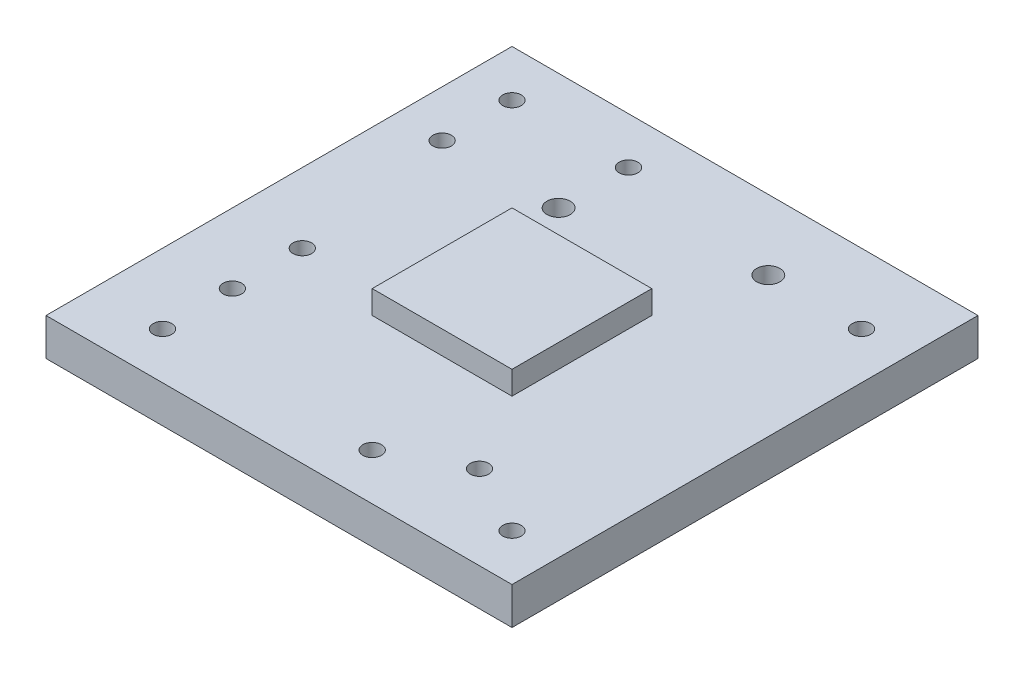
ISO-10303-21;
HEADER;
FILE_DESCRIPTION(('STEP AP214'),'2;1');
FILE_NAME('part.step','',(''),(''),'','','');
FILE_SCHEMA(('AUTOMOTIVE_DESIGN { 1 0 10303 214 1 1 1 1 }'));
ENDSEC;
DATA;
#1=APPLICATION_CONTEXT('core data for automotive mechanical design processes');
#2=APPLICATION_PROTOCOL_DEFINITION('international standard','automotive_design',2000,#1);
#3=PRODUCT_CONTEXT('',#1,'mechanical');
#4=PRODUCT('Part','Part','',(#3));
#5=PRODUCT_RELATED_PRODUCT_CATEGORY('part','',(#4));
#6=PRODUCT_DEFINITION_FORMATION('','',#4);
#7=PRODUCT_DEFINITION_CONTEXT('part definition',#1,'design');
#8=PRODUCT_DEFINITION('design','',#6,#7);
#9=PRODUCT_DEFINITION_SHAPE('','',#8);
#10=(LENGTH_UNIT() NAMED_UNIT(*) SI_UNIT(.MILLI.,.METRE.));
#11=(NAMED_UNIT(*) PLANE_ANGLE_UNIT() SI_UNIT($,.RADIAN.));
#12=(NAMED_UNIT(*) SI_UNIT($,.STERADIAN.) SOLID_ANGLE_UNIT());
#13=UNCERTAINTY_MEASURE_WITH_UNIT(LENGTH_MEASURE(1.E-05),#10,'distance_accuracy_value','');
#14=(GEOMETRIC_REPRESENTATION_CONTEXT(3) GLOBAL_UNCERTAINTY_ASSIGNED_CONTEXT((#13)) GLOBAL_UNIT_ASSIGNED_CONTEXT((#10,
#11,#12)) REPRESENTATION_CONTEXT('',''));
#15=CARTESIAN_POINT('',(0.,0.,0.));
#16=DIRECTION('',(0.,0.,1.));
#17=DIRECTION('',(1.,0.,0.));
#18=AXIS2_PLACEMENT_3D('',#15,#16,#17);
#19=CARTESIAN_POINT('',(0.,8.,0.));
#20=DIRECTION('',(0.,-1.,0.));
#21=DIRECTION('',(0.,0.,-1.));
#22=AXIS2_PLACEMENT_3D('',#19,#20,#21);
#23=PLANE('',#22);
#24=CARTESIAN_POINT('',(90.,8.,-10.));
#25=DIRECTION('',(0.,1.,0.));
#26=DIRECTION('',(0.,0.,1.));
#27=AXIS2_PLACEMENT_3D('',#24,#25,#26);
#28=CIRCLE('',#27,2.);
#29=CARTESIAN_POINT('',(90.,8.,-8.));
#30=VERTEX_POINT('',#29);
#31=EDGE_CURVE('E218',#30,#30,#28,.T.);
#32=ORIENTED_EDGE('',*,*,#31,.F.);
#33=EDGE_LOOP('',(#32));
#34=FACE_BOUND('',#33,.T.);
#35=CARTESIAN_POINT('',(60.,8.,-10.));
#36=DIRECTION('',(0.,1.,0.));
#37=DIRECTION('',(0.,0.,1.));
#38=AXIS2_PLACEMENT_3D('',#35,#36,#37);
#39=CIRCLE('',#38,2.);
#40=CARTESIAN_POINT('',(60.,8.,-8.));
#41=VERTEX_POINT('',#40);
#42=EDGE_CURVE('E513',#41,#41,#39,.T.);
#43=ORIENTED_EDGE('',*,*,#42,.F.);
#44=EDGE_LOOP('',(#43));
#45=FACE_BOUND('',#44,.T.);
#46=CARTESIAN_POINT('',(75.,8.,-18.0259116252399));
#47=DIRECTION('',(0.,1.,0.));
#48=DIRECTION('',(0.,0.,1.));
#49=AXIS2_PLACEMENT_3D('',#46,#47,#48);
#50=CIRCLE('',#49,2.);
#51=CARTESIAN_POINT('',(75.,8.,-16.0259116252399));
#52=VERTEX_POINT('',#51);
#53=EDGE_CURVE('E517',#52,#52,#50,.T.);
#54=ORIENTED_EDGE('',*,*,#53,.F.);
#55=EDGE_LOOP('',(#54));
#56=FACE_BOUND('',#55,.T.);
#57=CARTESIAN_POINT('',(15.,8.,-9.99999999999999));
#58=DIRECTION('',(0.,1.,0.));
#59=DIRECTION('',(0.,0.,1.));
#60=AXIS2_PLACEMENT_3D('',#57,#58,#59);
#61=CIRCLE('',#60,2.);
#62=CARTESIAN_POINT('',(15.,8.,-7.99999999999999));
#63=VERTEX_POINT('',#62);
#64=EDGE_CURVE('E205',#63,#63,#61,.T.);
#65=ORIENTED_EDGE('',*,*,#64,.F.);
#66=EDGE_LOOP('',(#65));
#67=FACE_BOUND('',#66,.T.);
#68=CARTESIAN_POINT('',(15.,8.,-25.));
#69=DIRECTION('',(0.,1.,0.));
#70=DIRECTION('',(0.,0.,1.));
#71=AXIS2_PLACEMENT_3D('',#68,#69,#70);
#72=CIRCLE('',#71,2.);
#73=CARTESIAN_POINT('',(15.,8.,-23.));
#74=VERTEX_POINT('',#73);
#75=EDGE_CURVE('E230',#74,#74,#72,.T.);
#76=ORIENTED_EDGE('',*,*,#75,.F.);
#77=EDGE_LOOP('',(#76));
#78=FACE_BOUND('',#77,.T.);
#79=CARTESIAN_POINT('',(15.,8.,-40.));
#80=DIRECTION('',(0.,1.,0.));
#81=DIRECTION('',(0.,0.,1.));
#82=AXIS2_PLACEMENT_3D('',#79,#80,#81);
#83=CIRCLE('',#82,2.);
#84=CARTESIAN_POINT('',(15.,8.,-38.));
#85=VERTEX_POINT('',#84);
#86=EDGE_CURVE('E225',#85,#85,#83,.T.);
#87=ORIENTED_EDGE('',*,*,#86,.F.);
#88=EDGE_LOOP('',(#87));
#89=FACE_BOUND('',#88,.T.);
#90=CARTESIAN_POINT('',(90.,8.,-85.));
#91=DIRECTION('',(0.,1.,0.));
#92=DIRECTION('',(0.,0.,1.));
#93=AXIS2_PLACEMENT_3D('',#90,#91,#92);
#94=CIRCLE('',#93,2.);
#95=CARTESIAN_POINT('',(90.,8.,-83.));
#96=VERTEX_POINT('',#95);
#97=EDGE_CURVE('E195',#96,#96,#94,.T.);
#98=ORIENTED_EDGE('',*,*,#97,.F.);
#99=EDGE_LOOP('',(#98));
#100=FACE_BOUND('',#99,.T.);
#101=CARTESIAN_POINT('',(70.,8.,-85.));
#102=DIRECTION('',(0.,1.,0.));
#103=DIRECTION('',(0.,0.,1.));
#104=AXIS2_PLACEMENT_3D('',#101,#102,#103);
#105=CIRCLE('',#104,2.5);
#106=CARTESIAN_POINT('',(70.,8.,-82.5));
#107=VERTEX_POINT('',#106);
#108=EDGE_CURVE('E213',#107,#107,#105,.T.);
#109=ORIENTED_EDGE('',*,*,#108,.F.);
#110=EDGE_LOOP('',(#109));
#111=FACE_BOUND('',#110,.T.);
#112=CARTESIAN_POINT('',(35.,8.,-90.));
#113=DIRECTION('',(0.,1.,0.));
#114=DIRECTION('',(0.,0.,1.));
#115=AXIS2_PLACEMENT_3D('',#112,#113,#114);
#116=CIRCLE('',#115,2.);
#117=CARTESIAN_POINT('',(35.,8.,-88.));
#118=VERTEX_POINT('',#117);
#119=EDGE_CURVE('E249',#118,#118,#116,.T.);
#120=ORIENTED_EDGE('',*,*,#119,.F.);
#121=EDGE_LOOP('',(#120));
#122=FACE_BOUND('',#121,.T.);
#123=CARTESIAN_POINT('',(10.,8.,-75.));
#124=DIRECTION('',(0.,1.,0.));
#125=DIRECTION('',(0.,0.,1.));
#126=AXIS2_PLACEMENT_3D('',#123,#124,#125);
#127=CIRCLE('',#126,2.);
#128=CARTESIAN_POINT('',(10.,8.,-73.));
#129=VERTEX_POINT('',#128);
#130=EDGE_CURVE('E248',#129,#129,#127,.T.);
#131=ORIENTED_EDGE('',*,*,#130,.F.);
#132=EDGE_LOOP('',(#131));
#133=FACE_BOUND('',#132,.T.);
#134=CARTESIAN_POINT('',(35.,8.,-75.));
#135=DIRECTION('',(0.,1.,0.));
#136=DIRECTION('',(0.,0.,1.));
#137=AXIS2_PLACEMENT_3D('',#134,#135,#136);
#138=CIRCLE('',#137,2.5);
#139=CARTESIAN_POINT('',(35.,8.,-72.5));
#140=VERTEX_POINT('',#139);
#141=EDGE_CURVE('E199',#140,#140,#138,.T.);
#142=ORIENTED_EDGE('',*,*,#141,.F.);
#143=EDGE_LOOP('',(#142));
#144=FACE_BOUND('',#143,.T.);
#145=CARTESIAN_POINT('',(10.,8.,-90.));
#146=DIRECTION('',(0.,1.,0.));
#147=DIRECTION('',(0.,0.,1.));
#148=AXIS2_PLACEMENT_3D('',#145,#146,#147);
#149=CIRCLE('',#148,2.);
#150=CARTESIAN_POINT('',(10.,8.,-88.));
#151=VERTEX_POINT('',#150);
#152=EDGE_CURVE('E178',#151,#151,#149,.T.);
#153=ORIENTED_EDGE('',*,*,#152,.F.);
#154=EDGE_LOOP('',(#153));
#155=FACE_BOUND('',#154,.T.);
#156=DIRECTION('',(0.,0.,1.));
#157=VECTOR('',#156,1.);
#158=CARTESIAN_POINT('',(0.,8.,0.));
#159=LINE('',#158,#157);
#160=CARTESIAN_POINT('',(0.,8.,-100.));
#161=VERTEX_POINT('',#160);
#162=CARTESIAN_POINT('',(0.,8.,0.));
#163=VERTEX_POINT('',#162);
#164=EDGE_CURVE('E141',#161,#163,#159,.T.);
#165=ORIENTED_EDGE('',*,*,#164,.T.);
#166=DIRECTION('',(1.,0.,0.));
#167=VECTOR('',#166,1.);
#168=CARTESIAN_POINT('',(0.,8.,0.));
#169=LINE('',#168,#167);
#170=CARTESIAN_POINT('',(100.,8.,0.));
#171=VERTEX_POINT('',#170);
#172=EDGE_CURVE('E145',#163,#171,#169,.T.);
#173=ORIENTED_EDGE('',*,*,#172,.T.);
#174=DIRECTION('',(0.,0.,-1.));
#175=VECTOR('',#174,1.);
#176=CARTESIAN_POINT('',(100.,8.,0.));
#177=LINE('',#176,#175);
#178=CARTESIAN_POINT('',(100.,8.,-100.));
#179=VERTEX_POINT('',#178);
#180=EDGE_CURVE('E149',#171,#179,#177,.T.);
#181=ORIENTED_EDGE('',*,*,#180,.T.);
#182=DIRECTION('',(-1.,0.,0.));
#183=VECTOR('',#182,1.);
#184=CARTESIAN_POINT('',(0.,8.,-100.));
#185=LINE('',#184,#183);
#186=EDGE_CURVE('E152',#179,#161,#185,.T.);
#187=ORIENTED_EDGE('',*,*,#186,.T.);
#188=EDGE_LOOP('',(#165,#173,#181,#187));
#189=FACE_BOUND('',#188,.T.);
#190=DIRECTION('',(0.,0.,1.));
#191=VECTOR('',#190,1.);
#192=CARTESIAN_POINT('',(35.,8.,-35.));
#193=LINE('',#192,#191);
#194=CARTESIAN_POINT('',(35.,8.,-65.));
#195=VERTEX_POINT('',#194);
#196=CARTESIAN_POINT('',(35.,8.,-35.));
#197=VERTEX_POINT('',#196);
#198=EDGE_CURVE('E57',#195,#197,#193,.T.);
#199=ORIENTED_EDGE('',*,*,#198,.F.);
#200=DIRECTION('',(-1.,0.,0.));
#201=VECTOR('',#200,1.);
#202=CARTESIAN_POINT('',(35.,8.,-65.));
#203=LINE('',#202,#201);
#204=CARTESIAN_POINT('',(65.,8.,-65.));
#205=VERTEX_POINT('',#204);
#206=EDGE_CURVE('E61',#205,#195,#203,.T.);
#207=ORIENTED_EDGE('',*,*,#206,.F.);
#208=DIRECTION('',(0.,0.,-1.));
#209=VECTOR('',#208,1.);
#210=CARTESIAN_POINT('',(65.,8.,-35.));
#211=LINE('',#210,#209);
#212=CARTESIAN_POINT('',(65.,8.,-35.));
#213=VERTEX_POINT('',#212);
#214=EDGE_CURVE('E269',#213,#205,#211,.T.);
#215=ORIENTED_EDGE('',*,*,#214,.F.);
#216=DIRECTION('',(1.,0.,0.));
#217=VECTOR('',#216,1.);
#218=CARTESIAN_POINT('',(35.,8.,-35.));
#219=LINE('',#218,#217);
#220=EDGE_CURVE('E266',#197,#213,#219,.T.);
#221=ORIENTED_EDGE('',*,*,#220,.F.);
#222=EDGE_LOOP('',(#199,#207,#215,#221));
#223=FACE_BOUND('',#222,.T.);
#224=ADVANCED_FACE('F39',(#34,#45,#56,#67,#78,#89,#100,#111,#122,#133,#144,#155,#189,#223),#23,.F.);
#225=CARTESIAN_POINT('',(0.,8.,0.));
#226=DIRECTION('',(1.,0.,0.));
#227=DIRECTION('',(0.,0.,-1.));
#228=AXIS2_PLACEMENT_3D('',#225,#226,#227);
#229=PLANE('',#228);
#230=DIRECTION('',(0.,0.,1.));
#231=VECTOR('',#230,1.);
#232=CARTESIAN_POINT('',(0.,0.,0.));
#233=LINE('',#232,#231);
#234=CARTESIAN_POINT('',(0.,0.,-100.));
#235=VERTEX_POINT('',#234);
#236=CARTESIAN_POINT('',(0.,0.,0.));
#237=VERTEX_POINT('',#236);
#238=EDGE_CURVE('E130',#235,#237,#233,.T.);
#239=ORIENTED_EDGE('',*,*,#238,.T.);
#240=DIRECTION('',(0.,-1.,0.));
#241=VECTOR('',#240,1.);
#242=CARTESIAN_POINT('',(0.,8.,0.));
#243=LINE('',#242,#241);
#244=EDGE_CURVE('E11',#163,#237,#243,.T.);
#245=ORIENTED_EDGE('',*,*,#244,.F.);
#246=ORIENTED_EDGE('',*,*,#164,.F.);
#247=DIRECTION('',(0.,-1.,0.));
#248=VECTOR('',#247,1.);
#249=CARTESIAN_POINT('',(0.,8.,-100.));
#250=LINE('',#249,#248);
#251=EDGE_CURVE('E154',#161,#235,#250,.T.);
#252=ORIENTED_EDGE('',*,*,#251,.T.);
#253=EDGE_LOOP('',(#239,#245,#246,#252));
#254=FACE_BOUND('',#253,.T.);
#255=ADVANCED_FACE('F41',(#254),#229,.F.);
#256=CARTESIAN_POINT('',(0.,8.,0.));
#257=DIRECTION('',(0.,0.,-1.));
#258=DIRECTION('',(-1.,0.,0.));
#259=AXIS2_PLACEMENT_3D('',#256,#257,#258);
#260=PLANE('',#259);
#261=DIRECTION('',(1.,0.,0.));
#262=VECTOR('',#261,1.);
#263=CARTESIAN_POINT('',(0.,0.,0.));
#264=LINE('',#263,#262);
#265=CARTESIAN_POINT('',(100.,0.,0.));
#266=VERTEX_POINT('',#265);
#267=EDGE_CURVE('E135',#237,#266,#264,.T.);
#268=ORIENTED_EDGE('',*,*,#267,.T.);
#269=DIRECTION('',(0.,-1.,0.));
#270=VECTOR('',#269,1.);
#271=CARTESIAN_POINT('',(100.,8.,0.));
#272=LINE('',#271,#270);
#273=EDGE_CURVE('E49',#171,#266,#272,.T.);
#274=ORIENTED_EDGE('',*,*,#273,.F.);
#275=ORIENTED_EDGE('',*,*,#172,.F.);
#276=ORIENTED_EDGE('',*,*,#244,.T.);
#277=EDGE_LOOP('',(#268,#274,#275,#276));
#278=FACE_BOUND('',#277,.T.);
#279=ADVANCED_FACE('F288',(#278),#260,.F.);
#280=CARTESIAN_POINT('',(100.,8.,0.));
#281=DIRECTION('',(-1.,0.,0.));
#282=DIRECTION('',(0.,0.,1.));
#283=AXIS2_PLACEMENT_3D('',#280,#281,#282);
#284=PLANE('',#283);
#285=DIRECTION('',(0.,0.,-1.));
#286=VECTOR('',#285,1.);
#287=CARTESIAN_POINT('',(100.,0.,0.));
#288=LINE('',#287,#286);
#289=CARTESIAN_POINT('',(100.,0.,-100.));
#290=VERTEX_POINT('',#289);
#291=EDGE_CURVE('E158',#266,#290,#288,.T.);
#292=ORIENTED_EDGE('',*,*,#291,.T.);
#293=DIRECTION('',(0.,-1.,0.));
#294=VECTOR('',#293,1.);
#295=CARTESIAN_POINT('',(100.,8.,-100.));
#296=LINE('',#295,#294);
#297=EDGE_CURVE('E166',#179,#290,#296,.T.);
#298=ORIENTED_EDGE('',*,*,#297,.F.);
#299=ORIENTED_EDGE('',*,*,#180,.F.);
#300=ORIENTED_EDGE('',*,*,#273,.T.);
#301=EDGE_LOOP('',(#292,#298,#299,#300));
#302=FACE_BOUND('',#301,.T.);
#303=ADVANCED_FACE('F302',(#302),#284,.F.);
#304=CARTESIAN_POINT('',(0.,8.,-100.));
#305=DIRECTION('',(0.,0.,1.));
#306=DIRECTION('',(1.,0.,0.));
#307=AXIS2_PLACEMENT_3D('',#304,#305,#306);
#308=PLANE('',#307);
#309=DIRECTION('',(-1.,0.,0.));
#310=VECTOR('',#309,1.);
#311=CARTESIAN_POINT('',(0.,0.,-100.));
#312=LINE('',#311,#310);
#313=EDGE_CURVE('E146',#290,#235,#312,.T.);
#314=ORIENTED_EDGE('',*,*,#313,.T.);
#315=ORIENTED_EDGE('',*,*,#251,.F.);
#316=ORIENTED_EDGE('',*,*,#186,.F.);
#317=ORIENTED_EDGE('',*,*,#297,.T.);
#318=EDGE_LOOP('',(#314,#315,#316,#317));
#319=FACE_BOUND('',#318,.T.);
#320=ADVANCED_FACE('F298',(#319),#308,.F.);
#321=CARTESIAN_POINT('',(0.,0.,0.));
#322=DIRECTION('',(0.,-1.,0.));
#323=DIRECTION('',(0.,0.,-1.));
#324=AXIS2_PLACEMENT_3D('',#321,#322,#323);
#325=PLANE('',#324);
#326=CARTESIAN_POINT('',(90.,0.,-10.));
#327=DIRECTION('',(0.,-1.,0.));
#328=DIRECTION('',(0.,0.,-1.));
#329=AXIS2_PLACEMENT_3D('',#326,#327,#328);
#330=CIRCLE('',#329,2.);
#331=CARTESIAN_POINT('',(90.,0.,-12.));
#332=VERTEX_POINT('',#331);
#333=EDGE_CURVE('E43',#332,#332,#330,.T.);
#334=ORIENTED_EDGE('',*,*,#333,.F.);
#335=EDGE_LOOP('',(#334));
#336=FACE_BOUND('',#335,.T.);
#337=CARTESIAN_POINT('',(60.,0.,-10.));
#338=DIRECTION('',(0.,-1.,0.));
#339=DIRECTION('',(0.,0.,-1.));
#340=AXIS2_PLACEMENT_3D('',#337,#338,#339);
#341=CIRCLE('',#340,2.);
#342=CARTESIAN_POINT('',(60.,0.,-12.));
#343=VERTEX_POINT('',#342);
#344=EDGE_CURVE('E217',#343,#343,#341,.T.);
#345=ORIENTED_EDGE('',*,*,#344,.F.);
#346=EDGE_LOOP('',(#345));
#347=FACE_BOUND('',#346,.T.);
#348=CARTESIAN_POINT('',(75.,0.,-18.0259116252399));
#349=DIRECTION('',(0.,-1.,0.));
#350=DIRECTION('',(0.,0.,-1.));
#351=AXIS2_PLACEMENT_3D('',#348,#349,#350);
#352=CIRCLE('',#351,2.);
#353=CARTESIAN_POINT('',(75.,0.,-20.0259116252399));
#354=VERTEX_POINT('',#353);
#355=EDGE_CURVE('E214',#354,#354,#352,.T.);
#356=ORIENTED_EDGE('',*,*,#355,.F.);
#357=EDGE_LOOP('',(#356));
#358=FACE_BOUND('',#357,.T.);
#359=CARTESIAN_POINT('',(15.,0.,-9.99999999999999));
#360=DIRECTION('',(0.,-1.,0.));
#361=DIRECTION('',(0.,0.,-1.));
#362=AXIS2_PLACEMENT_3D('',#359,#360,#361);
#363=CIRCLE('',#362,2.);
#364=CARTESIAN_POINT('',(15.,0.,-12.));
#365=VERTEX_POINT('',#364);
#366=EDGE_CURVE('E209',#365,#365,#363,.T.);
#367=ORIENTED_EDGE('',*,*,#366,.F.);
#368=EDGE_LOOP('',(#367));
#369=FACE_BOUND('',#368,.T.);
#370=CARTESIAN_POINT('',(15.,0.,-25.));
#371=DIRECTION('',(0.,-1.,0.));
#372=DIRECTION('',(0.,0.,-1.));
#373=AXIS2_PLACEMENT_3D('',#370,#371,#372);
#374=CIRCLE('',#373,2.);
#375=CARTESIAN_POINT('',(15.,0.,-27.));
#376=VERTEX_POINT('',#375);
#377=EDGE_CURVE('E204',#376,#376,#374,.T.);
#378=ORIENTED_EDGE('',*,*,#377,.F.);
#379=EDGE_LOOP('',(#378));
#380=FACE_BOUND('',#379,.T.);
#381=CARTESIAN_POINT('',(15.,0.,-40.));
#382=DIRECTION('',(0.,-1.,0.));
#383=DIRECTION('',(0.,0.,-1.));
#384=AXIS2_PLACEMENT_3D('',#381,#382,#383);
#385=CIRCLE('',#384,2.);
#386=CARTESIAN_POINT('',(15.,0.,-42.));
#387=VERTEX_POINT('',#386);
#388=EDGE_CURVE('E200',#387,#387,#385,.T.);
#389=ORIENTED_EDGE('',*,*,#388,.F.);
#390=EDGE_LOOP('',(#389));
#391=FACE_BOUND('',#390,.T.);
#392=CARTESIAN_POINT('',(90.,0.,-85.));
#393=DIRECTION('',(0.,-1.,0.));
#394=DIRECTION('',(0.,0.,-1.));
#395=AXIS2_PLACEMENT_3D('',#392,#393,#394);
#396=CIRCLE('',#395,2.);
#397=CARTESIAN_POINT('',(90.,0.,-87.));
#398=VERTEX_POINT('',#397);
#399=EDGE_CURVE('E194',#398,#398,#396,.T.);
#400=ORIENTED_EDGE('',*,*,#399,.F.);
#401=EDGE_LOOP('',(#400));
#402=FACE_BOUND('',#401,.T.);
#403=CARTESIAN_POINT('',(70.,0.,-85.));
#404=DIRECTION('',(0.,-1.,0.));
#405=DIRECTION('',(0.,0.,-1.));
#406=AXIS2_PLACEMENT_3D('',#403,#404,#405);
#407=CIRCLE('',#406,2.5);
#408=CARTESIAN_POINT('',(70.,0.,-87.5));
#409=VERTEX_POINT('',#408);
#410=EDGE_CURVE('E190',#409,#409,#407,.T.);
#411=ORIENTED_EDGE('',*,*,#410,.F.);
#412=EDGE_LOOP('',(#411));
#413=FACE_BOUND('',#412,.T.);
#414=CARTESIAN_POINT('',(35.,0.,-90.));
#415=DIRECTION('',(0.,-1.,0.));
#416=DIRECTION('',(0.,0.,-1.));
#417=AXIS2_PLACEMENT_3D('',#414,#415,#416);
#418=CIRCLE('',#417,2.);
#419=CARTESIAN_POINT('',(35.,0.,-92.));
#420=VERTEX_POINT('',#419);
#421=EDGE_CURVE('E186',#420,#420,#418,.T.);
#422=ORIENTED_EDGE('',*,*,#421,.F.);
#423=EDGE_LOOP('',(#422));
#424=FACE_BOUND('',#423,.T.);
#425=CARTESIAN_POINT('',(10.,0.,-75.));
#426=DIRECTION('',(0.,-1.,0.));
#427=DIRECTION('',(0.,0.,-1.));
#428=AXIS2_PLACEMENT_3D('',#425,#426,#427);
#429=CIRCLE('',#428,2.);
#430=CARTESIAN_POINT('',(10.,0.,-77.));
#431=VERTEX_POINT('',#430);
#432=EDGE_CURVE('E182',#431,#431,#429,.T.);
#433=ORIENTED_EDGE('',*,*,#432,.F.);
#434=EDGE_LOOP('',(#433));
#435=FACE_BOUND('',#434,.T.);
#436=CARTESIAN_POINT('',(35.,0.,-75.));
#437=DIRECTION('',(0.,-1.,0.));
#438=DIRECTION('',(0.,0.,-1.));
#439=AXIS2_PLACEMENT_3D('',#436,#437,#438);
#440=CIRCLE('',#439,2.5);
#441=CARTESIAN_POINT('',(35.,0.,-77.5));
#442=VERTEX_POINT('',#441);
#443=EDGE_CURVE('E177',#442,#442,#440,.T.);
#444=ORIENTED_EDGE('',*,*,#443,.F.);
#445=EDGE_LOOP('',(#444));
#446=FACE_BOUND('',#445,.T.);
#447=CARTESIAN_POINT('',(10.,0.,-90.));
#448=DIRECTION('',(0.,-1.,0.));
#449=DIRECTION('',(0.,0.,-1.));
#450=AXIS2_PLACEMENT_3D('',#447,#448,#449);
#451=CIRCLE('',#450,2.);
#452=CARTESIAN_POINT('',(10.,0.,-92.));
#453=VERTEX_POINT('',#452);
#454=EDGE_CURVE('E173',#453,#453,#451,.T.);
#455=ORIENTED_EDGE('',*,*,#454,.F.);
#456=EDGE_LOOP('',(#455));
#457=FACE_BOUND('',#456,.T.);
#458=ORIENTED_EDGE('',*,*,#238,.F.);
#459=ORIENTED_EDGE('',*,*,#313,.F.);
#460=ORIENTED_EDGE('',*,*,#291,.F.);
#461=ORIENTED_EDGE('',*,*,#267,.F.);
#462=EDGE_LOOP('',(#458,#459,#460,#461));
#463=FACE_BOUND('',#462,.T.);
#464=ADVANCED_FACE('F295',(#336,#347,#358,#369,#380,#391,#402,#413,#424,#435,#446,#457,#463),
#325,.T.);
#465=CARTESIAN_POINT('',(35.,13.,-35.));
#466=DIRECTION('',(1.,0.,0.));
#467=DIRECTION('',(0.,0.,-1.));
#468=AXIS2_PLACEMENT_3D('',#465,#466,#467);
#469=PLANE('',#468);
#470=ORIENTED_EDGE('',*,*,#198,.T.);
#471=DIRECTION('',(0.,-1.,0.));
#472=VECTOR('',#471,1.);
#473=CARTESIAN_POINT('',(35.,13.,-35.));
#474=LINE('',#473,#472);
#475=CARTESIAN_POINT('',(35.,13.,-35.));
#476=VERTEX_POINT('',#475);
#477=EDGE_CURVE('E110',#476,#197,#474,.T.);
#478=ORIENTED_EDGE('',*,*,#477,.F.);
#479=DIRECTION('',(0.,0.,1.));
#480=VECTOR('',#479,1.);
#481=CARTESIAN_POINT('',(35.,13.,-35.));
#482=LINE('',#481,#480);
#483=CARTESIAN_POINT('',(35.,13.,-65.));
#484=VERTEX_POINT('',#483);
#485=EDGE_CURVE('E117',#484,#476,#482,.T.);
#486=ORIENTED_EDGE('',*,*,#485,.F.);
#487=DIRECTION('',(0.,-1.,0.));
#488=VECTOR('',#487,1.);
#489=CARTESIAN_POINT('',(35.,13.,-65.));
#490=LINE('',#489,#488);
#491=EDGE_CURVE('E263',#484,#195,#490,.T.);
#492=ORIENTED_EDGE('',*,*,#491,.T.);
#493=EDGE_LOOP('',(#470,#478,#486,#492));
#494=FACE_BOUND('',#493,.T.);
#495=ADVANCED_FACE('F128',(#494),#469,.F.);
#496=CARTESIAN_POINT('',(35.,13.,-35.));
#497=DIRECTION('',(0.,0.,-1.));
#498=DIRECTION('',(-1.,0.,0.));
#499=AXIS2_PLACEMENT_3D('',#496,#497,#498);
#500=PLANE('',#499);
#501=ORIENTED_EDGE('',*,*,#220,.T.);
#502=DIRECTION('',(0.,-1.,0.));
#503=VECTOR('',#502,1.);
#504=CARTESIAN_POINT('',(65.,13.,-35.));
#505=LINE('',#504,#503);
#506=CARTESIAN_POINT('',(65.,13.,-35.));
#507=VERTEX_POINT('',#506);
#508=EDGE_CURVE('E112',#507,#213,#505,.T.);
#509=ORIENTED_EDGE('',*,*,#508,.F.);
#510=DIRECTION('',(1.,0.,0.));
#511=VECTOR('',#510,1.);
#512=CARTESIAN_POINT('',(35.,13.,-35.));
#513=LINE('',#512,#511);
#514=EDGE_CURVE('E105',#476,#507,#513,.T.);
#515=ORIENTED_EDGE('',*,*,#514,.F.);
#516=ORIENTED_EDGE('',*,*,#477,.T.);
#517=EDGE_LOOP('',(#501,#509,#515,#516));
#518=FACE_BOUND('',#517,.T.);
#519=ADVANCED_FACE('F108',(#518),#500,.F.);
#520=CARTESIAN_POINT('',(65.,13.,-35.));
#521=DIRECTION('',(-1.,0.,0.));
#522=DIRECTION('',(0.,0.,1.));
#523=AXIS2_PLACEMENT_3D('',#520,#521,#522);
#524=PLANE('',#523);
#525=ORIENTED_EDGE('',*,*,#214,.T.);
#526=DIRECTION('',(0.,-1.,0.));
#527=VECTOR('',#526,1.);
#528=CARTESIAN_POINT('',(65.,13.,-65.));
#529=LINE('',#528,#527);
#530=CARTESIAN_POINT('',(65.,13.,-65.));
#531=VERTEX_POINT('',#530);
#532=EDGE_CURVE('E137',#531,#205,#529,.T.);
#533=ORIENTED_EDGE('',*,*,#532,.F.);
#534=DIRECTION('',(0.,0.,-1.));
#535=VECTOR('',#534,1.);
#536=CARTESIAN_POINT('',(65.,13.,-35.));
#537=LINE('',#536,#535);
#538=EDGE_CURVE('E116',#507,#531,#537,.T.);
#539=ORIENTED_EDGE('',*,*,#538,.F.);
#540=ORIENTED_EDGE('',*,*,#508,.T.);
#541=EDGE_LOOP('',(#525,#533,#539,#540));
#542=FACE_BOUND('',#541,.T.);
#543=ADVANCED_FACE('F281',(#542),#524,.F.);
#544=CARTESIAN_POINT('',(35.,13.,-65.));
#545=DIRECTION('',(0.,0.,1.));
#546=DIRECTION('',(1.,0.,0.));
#547=AXIS2_PLACEMENT_3D('',#544,#545,#546);
#548=PLANE('',#547);
#549=ORIENTED_EDGE('',*,*,#206,.T.);
#550=ORIENTED_EDGE('',*,*,#491,.F.);
#551=DIRECTION('',(-1.,0.,0.));
#552=VECTOR('',#551,1.);
#553=CARTESIAN_POINT('',(35.,13.,-65.));
#554=LINE('',#553,#552);
#555=EDGE_CURVE('E122',#531,#484,#554,.T.);
#556=ORIENTED_EDGE('',*,*,#555,.F.);
#557=ORIENTED_EDGE('',*,*,#532,.T.);
#558=EDGE_LOOP('',(#549,#550,#556,#557));
#559=FACE_BOUND('',#558,.T.);
#560=ADVANCED_FACE('F279',(#559),#548,.F.);
#561=CARTESIAN_POINT('',(0.,13.,0.));
#562=DIRECTION('',(0.,-1.,0.));
#563=DIRECTION('',(0.,0.,-1.));
#564=AXIS2_PLACEMENT_3D('',#561,#562,#563);
#565=PLANE('',#564);
#566=ORIENTED_EDGE('',*,*,#485,.T.);
#567=ORIENTED_EDGE('',*,*,#514,.T.);
#568=ORIENTED_EDGE('',*,*,#538,.T.);
#569=ORIENTED_EDGE('',*,*,#555,.T.);
#570=EDGE_LOOP('',(#566,#567,#568,#569));
#571=FACE_BOUND('',#570,.T.);
#572=ADVANCED_FACE('F120',(#571),#565,.F.);
#573=CARTESIAN_POINT('',(10.,-11.,-90.));
#574=DIRECTION('',(0.,1.,0.));
#575=DIRECTION('',(0.,0.,1.));
#576=AXIS2_PLACEMENT_3D('',#573,#574,#575);
#577=CYLINDRICAL_SURFACE('',#576,2.);
#578=ORIENTED_EDGE('',*,*,#454,.T.);
#579=EDGE_LOOP('',(#578));
#580=FACE_BOUND('',#579,.T.);
#581=ORIENTED_EDGE('',*,*,#152,.T.);
#582=EDGE_LOOP('',(#581));
#583=FACE_BOUND('',#582,.T.);
#584=ADVANCED_FACE('F365',(#580,#583),#577,.F.);
#585=CARTESIAN_POINT('',(35.,-11.,-75.));
#586=DIRECTION('',(0.,1.,0.));
#587=DIRECTION('',(0.,0.,1.));
#588=AXIS2_PLACEMENT_3D('',#585,#586,#587);
#589=CYLINDRICAL_SURFACE('',#588,2.5);
#590=ORIENTED_EDGE('',*,*,#443,.T.);
#591=EDGE_LOOP('',(#590));
#592=FACE_BOUND('',#591,.T.);
#593=ORIENTED_EDGE('',*,*,#141,.T.);
#594=EDGE_LOOP('',(#593));
#595=FACE_BOUND('',#594,.T.);
#596=ADVANCED_FACE('F372',(#592,#595),#589,.F.);
#597=CARTESIAN_POINT('',(10.,-11.,-75.));
#598=DIRECTION('',(0.,1.,0.));
#599=DIRECTION('',(0.,0.,1.));
#600=AXIS2_PLACEMENT_3D('',#597,#598,#599);
#601=CYLINDRICAL_SURFACE('',#600,2.);
#602=ORIENTED_EDGE('',*,*,#432,.T.);
#603=EDGE_LOOP('',(#602));
#604=FACE_BOUND('',#603,.T.);
#605=ORIENTED_EDGE('',*,*,#130,.T.);
#606=EDGE_LOOP('',(#605));
#607=FACE_BOUND('',#606,.T.);
#608=ADVANCED_FACE('F380',(#604,#607),#601,.F.);
#609=CARTESIAN_POINT('',(35.,-11.,-90.));
#610=DIRECTION('',(0.,1.,0.));
#611=DIRECTION('',(0.,0.,1.));
#612=AXIS2_PLACEMENT_3D('',#609,#610,#611);
#613=CYLINDRICAL_SURFACE('',#612,2.);
#614=ORIENTED_EDGE('',*,*,#421,.T.);
#615=EDGE_LOOP('',(#614));
#616=FACE_BOUND('',#615,.T.);
#617=ORIENTED_EDGE('',*,*,#119,.T.);
#618=EDGE_LOOP('',(#617));
#619=FACE_BOUND('',#618,.T.);
#620=ADVANCED_FACE('F388',(#616,#619),#613,.F.);
#621=CARTESIAN_POINT('',(70.,-11.,-85.));
#622=DIRECTION('',(0.,1.,0.));
#623=DIRECTION('',(0.,0.,1.));
#624=AXIS2_PLACEMENT_3D('',#621,#622,#623);
#625=CYLINDRICAL_SURFACE('',#624,2.5);
#626=ORIENTED_EDGE('',*,*,#410,.T.);
#627=EDGE_LOOP('',(#626));
#628=FACE_BOUND('',#627,.T.);
#629=ORIENTED_EDGE('',*,*,#108,.T.);
#630=EDGE_LOOP('',(#629));
#631=FACE_BOUND('',#630,.T.);
#632=ADVANCED_FACE('F396',(#628,#631),#625,.F.);
#633=CARTESIAN_POINT('',(90.,-11.,-85.));
#634=DIRECTION('',(0.,1.,0.));
#635=DIRECTION('',(0.,0.,1.));
#636=AXIS2_PLACEMENT_3D('',#633,#634,#635);
#637=CYLINDRICAL_SURFACE('',#636,2.);
#638=ORIENTED_EDGE('',*,*,#399,.T.);
#639=EDGE_LOOP('',(#638));
#640=FACE_BOUND('',#639,.T.);
#641=ORIENTED_EDGE('',*,*,#97,.T.);
#642=EDGE_LOOP('',(#641));
#643=FACE_BOUND('',#642,.T.);
#644=ADVANCED_FACE('F404',(#640,#643),#637,.F.);
#645=CARTESIAN_POINT('',(15.,-11.,-40.));
#646=DIRECTION('',(0.,1.,0.));
#647=DIRECTION('',(0.,0.,1.));
#648=AXIS2_PLACEMENT_3D('',#645,#646,#647);
#649=CYLINDRICAL_SURFACE('',#648,2.);
#650=ORIENTED_EDGE('',*,*,#388,.T.);
#651=EDGE_LOOP('',(#650));
#652=FACE_BOUND('',#651,.T.);
#653=ORIENTED_EDGE('',*,*,#86,.T.);
#654=EDGE_LOOP('',(#653));
#655=FACE_BOUND('',#654,.T.);
#656=ADVANCED_FACE('F412',(#652,#655),#649,.F.);
#657=CARTESIAN_POINT('',(15.,-11.,-25.));
#658=DIRECTION('',(0.,1.,0.));
#659=DIRECTION('',(0.,0.,1.));
#660=AXIS2_PLACEMENT_3D('',#657,#658,#659);
#661=CYLINDRICAL_SURFACE('',#660,2.);
#662=ORIENTED_EDGE('',*,*,#377,.T.);
#663=EDGE_LOOP('',(#662));
#664=FACE_BOUND('',#663,.T.);
#665=ORIENTED_EDGE('',*,*,#75,.T.);
#666=EDGE_LOOP('',(#665));
#667=FACE_BOUND('',#666,.T.);
#668=ADVANCED_FACE('F420',(#664,#667),#661,.F.);
#669=CARTESIAN_POINT('',(15.,-11.,-9.99999999999999));
#670=DIRECTION('',(0.,1.,0.));
#671=DIRECTION('',(0.,0.,1.));
#672=AXIS2_PLACEMENT_3D('',#669,#670,#671);
#673=CYLINDRICAL_SURFACE('',#672,2.);
#674=ORIENTED_EDGE('',*,*,#366,.T.);
#675=EDGE_LOOP('',(#674));
#676=FACE_BOUND('',#675,.T.);
#677=ORIENTED_EDGE('',*,*,#64,.T.);
#678=EDGE_LOOP('',(#677));
#679=FACE_BOUND('',#678,.T.);
#680=ADVANCED_FACE('F428',(#676,#679),#673,.F.);
#681=CARTESIAN_POINT('',(75.,-11.,-18.0259116252399));
#682=DIRECTION('',(0.,1.,0.));
#683=DIRECTION('',(0.,0.,1.));
#684=AXIS2_PLACEMENT_3D('',#681,#682,#683);
#685=CYLINDRICAL_SURFACE('',#684,2.);
#686=ORIENTED_EDGE('',*,*,#355,.T.);
#687=EDGE_LOOP('',(#686));
#688=FACE_BOUND('',#687,.T.);
#689=ORIENTED_EDGE('',*,*,#53,.T.);
#690=EDGE_LOOP('',(#689));
#691=FACE_BOUND('',#690,.T.);
#692=ADVANCED_FACE('F436',(#688,#691),#685,.F.);
#693=CARTESIAN_POINT('',(60.,-11.,-10.));
#694=DIRECTION('',(0.,1.,0.));
#695=DIRECTION('',(0.,0.,1.));
#696=AXIS2_PLACEMENT_3D('',#693,#694,#695);
#697=CYLINDRICAL_SURFACE('',#696,2.);
#698=ORIENTED_EDGE('',*,*,#344,.T.);
#699=EDGE_LOOP('',(#698));
#700=FACE_BOUND('',#699,.T.);
#701=ORIENTED_EDGE('',*,*,#42,.T.);
#702=EDGE_LOOP('',(#701));
#703=FACE_BOUND('',#702,.T.);
#704=ADVANCED_FACE('F443',(#700,#703),#697,.F.);
#705=CARTESIAN_POINT('',(90.,-11.,-10.));
#706=DIRECTION('',(0.,1.,0.));
#707=DIRECTION('',(0.,0.,1.));
#708=AXIS2_PLACEMENT_3D('',#705,#706,#707);
#709=CYLINDRICAL_SURFACE('',#708,2.);
#710=ORIENTED_EDGE('',*,*,#333,.T.);
#711=EDGE_LOOP('',(#710));
#712=FACE_BOUND('',#711,.T.);
#713=ORIENTED_EDGE('',*,*,#31,.T.);
#714=EDGE_LOOP('',(#713));
#715=FACE_BOUND('',#714,.T.);
#716=ADVANCED_FACE('F451',(#712,#715),#709,.F.);
#717=CLOSED_SHELL('',(#224,#255,#279,#303,#320,#464,#495,#519,#543,#560,#572,#584,#596,#608,
#620,#632,#644,#656,#668,#680,#692,#704,#716));
#718=MANIFOLD_SOLID_BREP('B2',#717);
#719=ADVANCED_BREP_SHAPE_REPRESENTATION('',(#18,#718),#14);
#720=SHAPE_DEFINITION_REPRESENTATION(#9,#719);
ENDSEC;
END-ISO-10303-21;
